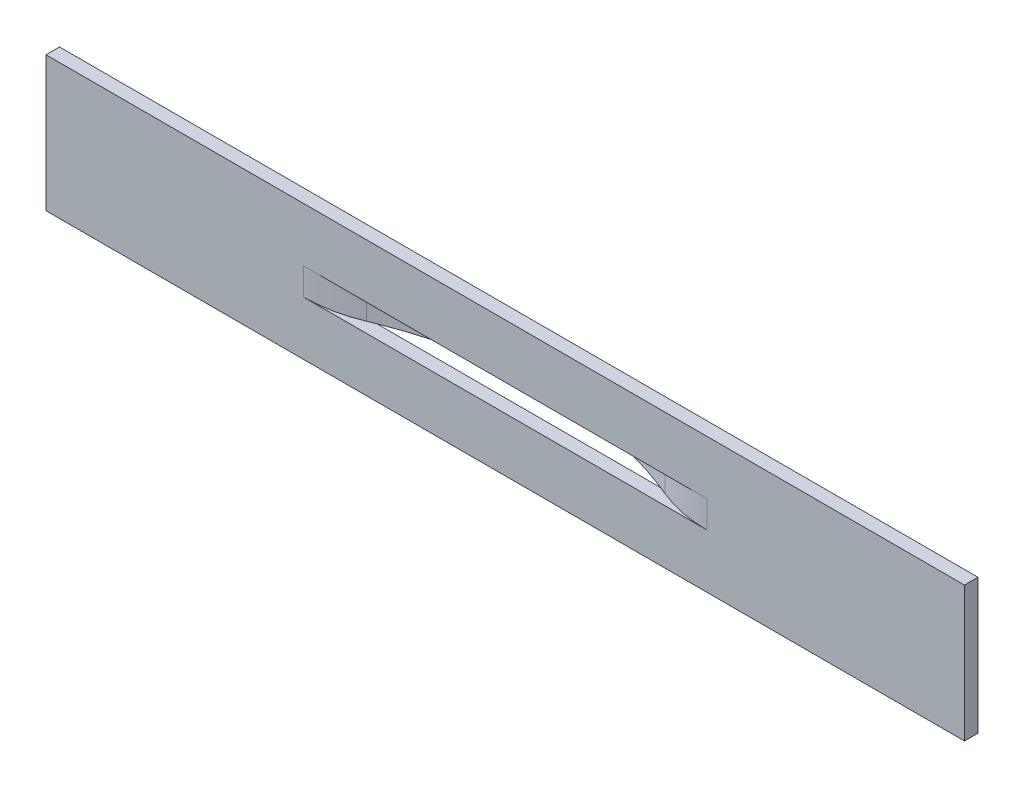
ISO-10303-21;
HEADER;
FILE_DESCRIPTION(('STEP AP214'),'2;1');
FILE_NAME('part.step','',(''),(''),'','','');
FILE_SCHEMA(('AUTOMOTIVE_DESIGN { 1 0 10303 214 1 1 1 1 }'));
ENDSEC;
DATA;
#1=APPLICATION_CONTEXT('core data for automotive mechanical design processes');
#2=APPLICATION_PROTOCOL_DEFINITION('international standard','automotive_design',2000,#1);
#3=PRODUCT_CONTEXT('',#1,'mechanical');
#4=PRODUCT('Part','Part','',(#3));
#5=PRODUCT_RELATED_PRODUCT_CATEGORY('part','',(#4));
#6=PRODUCT_DEFINITION_FORMATION('','',#4);
#7=PRODUCT_DEFINITION_CONTEXT('part definition',#1,'design');
#8=PRODUCT_DEFINITION('design','',#6,#7);
#9=PRODUCT_DEFINITION_SHAPE('','',#8);
#10=(LENGTH_UNIT() NAMED_UNIT(*) SI_UNIT(.MILLI.,.METRE.));
#11=(NAMED_UNIT(*) PLANE_ANGLE_UNIT() SI_UNIT($,.RADIAN.));
#12=(NAMED_UNIT(*) SI_UNIT($,.STERADIAN.) SOLID_ANGLE_UNIT());
#13=UNCERTAINTY_MEASURE_WITH_UNIT(LENGTH_MEASURE(1.E-05),#10,'distance_accuracy_value','');
#14=(GEOMETRIC_REPRESENTATION_CONTEXT(3) GLOBAL_UNCERTAINTY_ASSIGNED_CONTEXT((#13)) GLOBAL_UNIT_ASSIGNED_CONTEXT((#10,
#11,#12)) REPRESENTATION_CONTEXT('',''));
#15=CARTESIAN_POINT('',(0.,0.,0.));
#16=DIRECTION('',(0.,0.,1.));
#17=DIRECTION('',(1.,0.,0.));
#18=AXIS2_PLACEMENT_3D('',#15,#16,#17);
#19=CARTESIAN_POINT('',(0.,10.,0.));
#20=DIRECTION('',(0.,0.,-1.));
#21=DIRECTION('',(-1.,0.,0.));
#22=AXIS2_PLACEMENT_3D('',#19,#20,#21);
#23=PLANE('',#22);
#24=DIRECTION('',(1.,0.,0.));
#25=VECTOR('',#24,1.);
#26=CARTESIAN_POINT('',(0.,0.,0.));
#27=LINE('',#26,#25);
#28=CARTESIAN_POINT('',(0.,0.,0.));
#29=VERTEX_POINT('',#28);
#30=CARTESIAN_POINT('',(68.,0.,0.));
#31=VERTEX_POINT('',#30);
#32=EDGE_CURVE('E236',#29,#31,#27,.T.);
#33=ORIENTED_EDGE('',*,*,#32,.F.);
#34=DIRECTION('',(0.,-1.,0.));
#35=VECTOR('',#34,1.);
#36=CARTESIAN_POINT('',(0.,10.,0.));
#37=LINE('',#36,#35);
#38=CARTESIAN_POINT('',(0.,10.,0.));
#39=VERTEX_POINT('',#38);
#40=EDGE_CURVE('E242',#39,#29,#37,.T.);
#41=ORIENTED_EDGE('',*,*,#40,.F.);
#42=DIRECTION('',(1.,0.,0.));
#43=VECTOR('',#42,1.);
#44=CARTESIAN_POINT('',(0.,10.,0.));
#45=LINE('',#44,#43);
#46=CARTESIAN_POINT('',(68.,10.,0.));
#47=VERTEX_POINT('',#46);
#48=EDGE_CURVE('E224',#39,#47,#45,.T.);
#49=ORIENTED_EDGE('',*,*,#48,.T.);
#50=DIRECTION('',(0.,-1.,0.));
#51=VECTOR('',#50,1.);
#52=CARTESIAN_POINT('',(68.,10.,0.));
#53=LINE('',#52,#51);
#54=EDGE_CURVE('E244',#47,#31,#53,.T.);
#55=ORIENTED_EDGE('',*,*,#54,.T.);
#56=EDGE_LOOP('',(#33,#41,#49,#55));
#57=FACE_BOUND('',#56,.T.);
#58=DIRECTION('',(0.,-1.,0.));
#59=VECTOR('',#58,1.);
#60=CARTESIAN_POINT('',(19.0814712521643,6.,0.));
#61=LINE('',#60,#59);
#62=CARTESIAN_POINT('',(19.0814712521643,6.,0.));
#63=VERTEX_POINT('',#62);
#64=CARTESIAN_POINT('',(19.0814712521643,4.,0.));
#65=VERTEX_POINT('',#64);
#66=EDGE_CURVE('E162',#63,#65,#61,.T.);
#67=ORIENTED_EDGE('',*,*,#66,.T.);
#68=DIRECTION('',(-1.,0.,0.));
#69=VECTOR('',#68,1.);
#70=CARTESIAN_POINT('',(0.,4.,0.));
#71=LINE('',#70,#69);
#72=CARTESIAN_POINT('',(23.4940493052747,4.,0.));
#73=VERTEX_POINT('',#72);
#74=EDGE_CURVE('E184',#65,#73,#71,.F.);
#75=ORIENTED_EDGE('',*,*,#74,.T.);
#76=DIRECTION('',(1.,0.,0.));
#77=VECTOR('',#76,1.);
#78=CARTESIAN_POINT('',(0.,4.,0.));
#79=LINE('',#78,#77);
#80=CARTESIAN_POINT('',(44.5059506947253,4.,0.));
#81=VERTEX_POINT('',#80);
#82=EDGE_CURVE('E49',#73,#81,#79,.T.);
#83=ORIENTED_EDGE('',*,*,#82,.T.);
#84=CARTESIAN_POINT('',(48.9185287478357,4.,0.));
#85=VERTEX_POINT('',#84);
#86=EDGE_CURVE('E182',#81,#85,#71,.F.);
#87=ORIENTED_EDGE('',*,*,#86,.T.);
#88=DIRECTION('',(0.,-1.,0.));
#89=VECTOR('',#88,1.);
#90=CARTESIAN_POINT('',(48.9185287478357,6.,0.));
#91=LINE('',#90,#89);
#92=CARTESIAN_POINT('',(48.9185287478357,6.,0.));
#93=VERTEX_POINT('',#92);
#94=EDGE_CURVE('E56',#85,#93,#91,.F.);
#95=ORIENTED_EDGE('',*,*,#94,.T.);
#96=DIRECTION('',(-1.,0.,0.));
#97=VECTOR('',#96,1.);
#98=CARTESIAN_POINT('',(0.,6.,0.));
#99=LINE('',#98,#97);
#100=CARTESIAN_POINT('',(44.5059506947253,6.,0.));
#101=VERTEX_POINT('',#100);
#102=EDGE_CURVE('E161',#93,#101,#99,.T.);
#103=ORIENTED_EDGE('',*,*,#102,.T.);
#104=DIRECTION('',(1.,0.,0.));
#105=VECTOR('',#104,1.);
#106=CARTESIAN_POINT('',(0.,6.,0.));
#107=LINE('',#106,#105);
#108=CARTESIAN_POINT('',(23.4940493052747,6.,0.));
#109=VERTEX_POINT('',#108);
#110=EDGE_CURVE('E11',#109,#101,#107,.T.);
#111=ORIENTED_EDGE('',*,*,#110,.F.);
#112=EDGE_CURVE('E178',#109,#63,#99,.T.);
#113=ORIENTED_EDGE('',*,*,#112,.T.);
#114=EDGE_LOOP('',(#67,#75,#83,#87,#95,#103,#111,#113));
#115=FACE_BOUND('',#114,.T.);
#116=ADVANCED_FACE('F41',(#57,#115),#23,.T.);
#117=CARTESIAN_POINT('',(0.,10.,1.));
#118=DIRECTION('',(0.,0.,-1.));
#119=DIRECTION('',(-1.,0.,0.));
#120=AXIS2_PLACEMENT_3D('',#117,#118,#119);
#121=PLANE('',#120);
#122=DIRECTION('',(1.,0.,0.));
#123=VECTOR('',#122,1.);
#124=CARTESIAN_POINT('',(0.,0.,1.));
#125=LINE('',#124,#123);
#126=CARTESIAN_POINT('',(0.,0.,1.));
#127=VERTEX_POINT('',#126);
#128=CARTESIAN_POINT('',(68.,0.,1.));
#129=VERTEX_POINT('',#128);
#130=EDGE_CURVE('E217',#127,#129,#125,.T.);
#131=ORIENTED_EDGE('',*,*,#130,.T.);
#132=DIRECTION('',(0.,-1.,0.));
#133=VECTOR('',#132,1.);
#134=CARTESIAN_POINT('',(68.,10.,1.));
#135=LINE('',#134,#133);
#136=CARTESIAN_POINT('',(68.,10.,1.));
#137=VERTEX_POINT('',#136);
#138=EDGE_CURVE('E246',#137,#129,#135,.T.);
#139=ORIENTED_EDGE('',*,*,#138,.F.);
#140=DIRECTION('',(1.,0.,0.));
#141=VECTOR('',#140,1.);
#142=CARTESIAN_POINT('',(0.,10.,1.));
#143=LINE('',#142,#141);
#144=CARTESIAN_POINT('',(0.,10.,1.));
#145=VERTEX_POINT('',#144);
#146=EDGE_CURVE('E218',#145,#137,#143,.T.);
#147=ORIENTED_EDGE('',*,*,#146,.F.);
#148=DIRECTION('',(0.,-1.,0.));
#149=VECTOR('',#148,1.);
#150=CARTESIAN_POINT('',(0.,10.,1.));
#151=LINE('',#150,#149);
#152=EDGE_CURVE('E230',#145,#127,#151,.T.);
#153=ORIENTED_EDGE('',*,*,#152,.T.);
#154=EDGE_LOOP('',(#131,#139,#147,#153));
#155=FACE_BOUND('',#154,.T.);
#156=DIRECTION('',(0.,1.,0.));
#157=VECTOR('',#156,1.);
#158=CARTESIAN_POINT('',(19.0814712521643,4.,1.));
#159=LINE('',#158,#157);
#160=CARTESIAN_POINT('',(19.0814712521643,6.,1.));
#161=VERTEX_POINT('',#160);
#162=CARTESIAN_POINT('',(19.0814712521643,4.,1.));
#163=VERTEX_POINT('',#162);
#164=EDGE_CURVE('E199',#161,#163,#159,.F.);
#165=ORIENTED_EDGE('',*,*,#164,.F.);
#166=DIRECTION('',(-1.,0.,0.));
#167=VECTOR('',#166,1.);
#168=CARTESIAN_POINT('',(46.75,6.,1.));
#169=LINE('',#168,#167);
#170=CARTESIAN_POINT('',(48.9185287478357,6.,1.));
#171=VERTEX_POINT('',#170);
#172=EDGE_CURVE('E188',#171,#161,#169,.T.);
#173=ORIENTED_EDGE('',*,*,#172,.F.);
#174=DIRECTION('',(0.,1.,0.));
#175=VECTOR('',#174,1.);
#176=CARTESIAN_POINT('',(48.9185287478357,6.,1.));
#177=LINE('',#176,#175);
#178=CARTESIAN_POINT('',(48.9185287478357,4.,1.));
#179=VERTEX_POINT('',#178);
#180=EDGE_CURVE('E191',#179,#171,#177,.T.);
#181=ORIENTED_EDGE('',*,*,#180,.F.);
#182=DIRECTION('',(-1.,0.,0.));
#183=VECTOR('',#182,1.);
#184=CARTESIAN_POINT('',(46.75,4.,1.));
#185=LINE('',#184,#183);
#186=EDGE_CURVE('E194',#179,#163,#185,.T.);
#187=ORIENTED_EDGE('',*,*,#186,.T.);
#188=EDGE_LOOP('',(#165,#173,#181,#187));
#189=FACE_BOUND('',#188,.T.);
#190=ADVANCED_FACE('F43',(#155,#189),#121,.F.);
#191=CARTESIAN_POINT('',(68.,10.,0.));
#192=DIRECTION('',(1.,0.,0.));
#193=DIRECTION('',(0.,0.,-1.));
#194=AXIS2_PLACEMENT_3D('',#191,#192,#193);
#195=PLANE('',#194);
#196=DIRECTION('',(0.,0.,1.));
#197=VECTOR('',#196,1.);
#198=CARTESIAN_POINT('',(68.,0.,0.));
#199=LINE('',#198,#197);
#200=EDGE_CURVE('E233',#31,#129,#199,.T.);
#201=ORIENTED_EDGE('',*,*,#200,.F.);
#202=ORIENTED_EDGE('',*,*,#54,.F.);
#203=DIRECTION('',(0.,0.,1.));
#204=VECTOR('',#203,1.);
#205=CARTESIAN_POINT('',(68.,10.,0.));
#206=LINE('',#205,#204);
#207=EDGE_CURVE('E220',#47,#137,#206,.T.);
#208=ORIENTED_EDGE('',*,*,#207,.T.);
#209=ORIENTED_EDGE('',*,*,#138,.T.);
#210=EDGE_LOOP('',(#201,#202,#208,#209));
#211=FACE_BOUND('',#210,.T.);
#212=ADVANCED_FACE('F285',(#211),#195,.T.);
#213=CARTESIAN_POINT('',(0.,10.,1.));
#214=DIRECTION('',(-1.,0.,0.));
#215=DIRECTION('',(0.,0.,1.));
#216=AXIS2_PLACEMENT_3D('',#213,#214,#215);
#217=PLANE('',#216);
#218=DIRECTION('',(0.,0.,-1.));
#219=VECTOR('',#218,1.);
#220=CARTESIAN_POINT('',(0.,0.,1.));
#221=LINE('',#220,#219);
#222=EDGE_CURVE('E221',#127,#29,#221,.T.);
#223=ORIENTED_EDGE('',*,*,#222,.F.);
#224=ORIENTED_EDGE('',*,*,#152,.F.);
#225=DIRECTION('',(0.,0.,-1.));
#226=VECTOR('',#225,1.);
#227=CARTESIAN_POINT('',(0.,10.,1.));
#228=LINE('',#227,#226);
#229=EDGE_CURVE('E227',#145,#39,#228,.T.);
#230=ORIENTED_EDGE('',*,*,#229,.T.);
#231=ORIENTED_EDGE('',*,*,#40,.T.);
#232=EDGE_LOOP('',(#223,#224,#230,#231));
#233=FACE_BOUND('',#232,.T.);
#234=ADVANCED_FACE('F289',(#233),#217,.T.);
#235=CARTESIAN_POINT('',(0.,10.,0.));
#236=DIRECTION('',(0.,-1.,0.));
#237=DIRECTION('',(-1.,0.,0.));
#238=AXIS2_PLACEMENT_3D('',#235,#236,#237);
#239=PLANE('',#238);
#240=ORIENTED_EDGE('',*,*,#146,.T.);
#241=ORIENTED_EDGE('',*,*,#207,.F.);
#242=ORIENTED_EDGE('',*,*,#48,.F.);
#243=ORIENTED_EDGE('',*,*,#229,.F.);
#244=EDGE_LOOP('',(#240,#241,#242,#243));
#245=FACE_BOUND('',#244,.T.);
#246=ADVANCED_FACE('F296',(#245),#239,.F.);
#247=CARTESIAN_POINT('',(0.,0.,0.));
#248=DIRECTION('',(0.,-1.,0.));
#249=DIRECTION('',(-1.,0.,0.));
#250=AXIS2_PLACEMENT_3D('',#247,#248,#249);
#251=PLANE('',#250);
#252=ORIENTED_EDGE('',*,*,#130,.F.);
#253=ORIENTED_EDGE('',*,*,#222,.T.);
#254=ORIENTED_EDGE('',*,*,#32,.T.);
#255=ORIENTED_EDGE('',*,*,#200,.T.);
#256=EDGE_LOOP('',(#252,#253,#254,#255));
#257=FACE_BOUND('',#256,.T.);
#258=ADVANCED_FACE('F303',(#257),#251,.T.);
#259=CARTESIAN_POINT('',(34.,6.,26.59375));
#260=DIRECTION('',(0.,-1.,0.));
#261=DIRECTION('',(1.,0.,0.));
#262=AXIS2_PLACEMENT_3D('',#259,#260,#261);
#263=CYLINDRICAL_SURFACE('',#262,28.59375);
#264=CARTESIAN_POINT('',(34.,4.,26.59375));
#265=DIRECTION('',(0.,1.,0.));
#266=DIRECTION('',(-1.,0.,0.));
#267=AXIS2_PLACEMENT_3D('',#264,#265,#266);
#268=CIRCLE('',#267,28.59375);
#269=CARTESIAN_POINT('',(45.0529990317973,4.,0.222672064777325));
#270=VERTEX_POINT('',#269);
#271=EDGE_CURVE('E192',#270,#81,#268,.T.);
#272=ORIENTED_EDGE('',*,*,#271,.F.);
#273=DIRECTION('',(0.,-1.,0.));
#274=VECTOR('',#273,1.);
#275=CARTESIAN_POINT('',(45.0529990317973,6.,0.222672064777318));
#276=LINE('',#275,#274);
#277=CARTESIAN_POINT('',(45.0529990317973,6.,0.222672064777325));
#278=VERTEX_POINT('',#277);
#279=EDGE_CURVE('E201',#278,#270,#276,.T.);
#280=ORIENTED_EDGE('',*,*,#279,.F.);
#281=CARTESIAN_POINT('',(34.,6.,26.59375));
#282=DIRECTION('',(0.,1.,0.));
#283=DIRECTION('',(-1.,0.,0.));
#284=AXIS2_PLACEMENT_3D('',#281,#282,#283);
#285=CIRCLE('',#284,28.59375);
#286=EDGE_CURVE('E185',#278,#101,#285,.T.);
#287=ORIENTED_EDGE('',*,*,#286,.T.);
#288=CARTESIAN_POINT('',(34.,6.,26.59375));
#289=DIRECTION('',(0.,1.,0.));
#290=DIRECTION('',(-1.,0.,0.));
#291=AXIS2_PLACEMENT_3D('',#288,#289,#290);
#292=CIRCLE('',#291,28.59375);
#293=EDGE_CURVE('E181',#101,#109,#292,.T.);
#294=ORIENTED_EDGE('',*,*,#293,.T.);
#295=CARTESIAN_POINT('',(22.9470009682027,6.,0.222672064777325));
#296=VERTEX_POINT('',#295);
#297=EDGE_CURVE('E189',#109,#296,#285,.T.);
#298=ORIENTED_EDGE('',*,*,#297,.T.);
#299=DIRECTION('',(0.,-1.,0.));
#300=VECTOR('',#299,1.);
#301=CARTESIAN_POINT('',(22.9470009682027,6.,0.222672064777318));
#302=LINE('',#301,#300);
#303=CARTESIAN_POINT('',(22.9470009682027,4.,0.222672064777325));
#304=VERTEX_POINT('',#303);
#305=EDGE_CURVE('E204',#304,#296,#302,.F.);
#306=ORIENTED_EDGE('',*,*,#305,.F.);
#307=EDGE_CURVE('E195',#73,#304,#268,.T.);
#308=ORIENTED_EDGE('',*,*,#307,.F.);
#309=CARTESIAN_POINT('',(34.,4.,26.59375));
#310=DIRECTION('',(0.,1.,0.));
#311=DIRECTION('',(-1.,0.,0.));
#312=AXIS2_PLACEMENT_3D('',#309,#310,#311);
#313=CIRCLE('',#312,28.59375);
#314=EDGE_CURVE('E176',#81,#73,#313,.T.);
#315=ORIENTED_EDGE('',*,*,#314,.F.);
#316=EDGE_LOOP('',(#272,#280,#287,#294,#298,#306,#308,#315));
#317=FACE_BOUND('',#316,.T.);
#318=ADVANCED_FACE('F258',(#317),#263,.F.);
#319=CARTESIAN_POINT('',(34.,6.,26.59375));
#320=DIRECTION('',(0.,1.,0.));
#321=DIRECTION('',(-1.,0.,0.));
#322=AXIS2_PLACEMENT_3D('',#319,#320,#321);
#323=PLANE('',#322);
#324=ORIENTED_EDGE('',*,*,#110,.T.);
#325=ORIENTED_EDGE('',*,*,#286,.F.);
#326=CARTESIAN_POINT('',(48.9185287478357,6.,-9.));
#327=DIRECTION('',(0.,1.,0.));
#328=DIRECTION('',(-1.,0.,0.));
#329=AXIS2_PLACEMENT_3D('',#326,#327,#328);
#330=CIRCLE('',#329,10.);
#331=EDGE_CURVE('E215',#171,#278,#330,.F.);
#332=ORIENTED_EDGE('',*,*,#331,.F.);
#333=ORIENTED_EDGE('',*,*,#172,.T.);
#334=CARTESIAN_POINT('',(19.0814712521643,6.,-9.));
#335=DIRECTION('',(0.,1.,0.));
#336=DIRECTION('',(-1.,0.,0.));
#337=AXIS2_PLACEMENT_3D('',#334,#335,#336);
#338=CIRCLE('',#337,10.);
#339=EDGE_CURVE('E210',#296,#161,#338,.F.);
#340=ORIENTED_EDGE('',*,*,#339,.F.);
#341=ORIENTED_EDGE('',*,*,#297,.F.);
#342=EDGE_LOOP('',(#324,#325,#332,#333,#340,#341));
#343=FACE_BOUND('',#342,.T.);
#344=ADVANCED_FACE('F269',(#343),#323,.F.);
#345=CARTESIAN_POINT('',(34.,4.,26.59375));
#346=DIRECTION('',(0.,1.,0.));
#347=DIRECTION('',(-1.,0.,0.));
#348=AXIS2_PLACEMENT_3D('',#345,#346,#347);
#349=PLANE('',#348);
#350=ORIENTED_EDGE('',*,*,#307,.T.);
#351=CARTESIAN_POINT('',(19.0814712521643,4.,-9.));
#352=DIRECTION('',(0.,1.,0.));
#353=DIRECTION('',(-1.,0.,0.));
#354=AXIS2_PLACEMENT_3D('',#351,#352,#353);
#355=CIRCLE('',#354,10.);
#356=EDGE_CURVE('E207',#163,#304,#355,.T.);
#357=ORIENTED_EDGE('',*,*,#356,.F.);
#358=ORIENTED_EDGE('',*,*,#186,.F.);
#359=CARTESIAN_POINT('',(48.9185287478357,4.,-9.));
#360=DIRECTION('',(0.,1.,0.));
#361=DIRECTION('',(-1.,0.,0.));
#362=AXIS2_PLACEMENT_3D('',#359,#360,#361);
#363=CIRCLE('',#362,10.);
#364=EDGE_CURVE('E213',#270,#179,#363,.T.);
#365=ORIENTED_EDGE('',*,*,#364,.F.);
#366=ORIENTED_EDGE('',*,*,#271,.T.);
#367=ORIENTED_EDGE('',*,*,#82,.F.);
#368=EDGE_LOOP('',(#350,#357,#358,#365,#366,#367));
#369=FACE_BOUND('',#368,.T.);
#370=ADVANCED_FACE('F317',(#369),#349,.T.);
#371=CARTESIAN_POINT('',(19.0814712521643,6.,-9.));
#372=DIRECTION('',(0.,-1.,0.));
#373=DIRECTION('',(1.,0.,0.));
#374=AXIS2_PLACEMENT_3D('',#371,#372,#373);
#375=CYLINDRICAL_SURFACE('',#374,10.);
#376=ORIENTED_EDGE('',*,*,#339,.T.);
#377=ORIENTED_EDGE('',*,*,#164,.T.);
#378=ORIENTED_EDGE('',*,*,#356,.T.);
#379=ORIENTED_EDGE('',*,*,#305,.T.);
#380=EDGE_LOOP('',(#376,#377,#378,#379));
#381=FACE_BOUND('',#380,.T.);
#382=ADVANCED_FACE('F316',(#381),#375,.T.);
#383=CARTESIAN_POINT('',(48.9185287478357,6.,-9.));
#384=DIRECTION('',(0.,-1.,0.));
#385=DIRECTION('',(1.,0.,0.));
#386=AXIS2_PLACEMENT_3D('',#383,#384,#385);
#387=CYLINDRICAL_SURFACE('',#386,10.);
#388=ORIENTED_EDGE('',*,*,#331,.T.);
#389=ORIENTED_EDGE('',*,*,#279,.T.);
#390=ORIENTED_EDGE('',*,*,#364,.T.);
#391=ORIENTED_EDGE('',*,*,#180,.T.);
#392=EDGE_LOOP('',(#388,#389,#390,#391));
#393=FACE_BOUND('',#392,.T.);
#394=ADVANCED_FACE('F320',(#393),#387,.T.);
#395=CARTESIAN_POINT('',(19.0814712521643,4.,-9.));
#396=DIRECTION('',(0.,-1.,0.));
#397=DIRECTION('',(0.,0.,-1.));
#398=AXIS2_PLACEMENT_3D('',#395,#396,#397);
#399=PLANE('',#398);
#400=ORIENTED_EDGE('',*,*,#74,.F.);
#401=CARTESIAN_POINT('',(19.0814712521643,4.,-9.));
#402=DIRECTION('',(0.,-1.,0.));
#403=DIRECTION('',(0.,0.,-1.));
#404=AXIS2_PLACEMENT_3D('',#401,#402,#403);
#405=CIRCLE('',#404,9.);
#406=CARTESIAN_POINT('',(22.5604479965989,4.,-0.699595141700406));
#407=VERTEX_POINT('',#406);
#408=EDGE_CURVE('E64',#65,#407,#405,.F.);
#409=ORIENTED_EDGE('',*,*,#408,.T.);
#410=CARTESIAN_POINT('',(34.,4.,26.59375));
#411=DIRECTION('',(0.,-1.,0.));
#412=DIRECTION('',(0.,0.,-1.));
#413=AXIS2_PLACEMENT_3D('',#410,#411,#412);
#414=CIRCLE('',#413,29.59375);
#415=CARTESIAN_POINT('',(45.4395520034011,4.,-0.699595141700404));
#416=VERTEX_POINT('',#415);
#417=EDGE_CURVE('E167',#416,#407,#414,.F.);
#418=ORIENTED_EDGE('',*,*,#417,.F.);
#419=CARTESIAN_POINT('',(48.9185287478357,4.,-9.));
#420=DIRECTION('',(0.,-1.,0.));
#421=DIRECTION('',(0.,0.,-1.));
#422=AXIS2_PLACEMENT_3D('',#419,#420,#421);
#423=CIRCLE('',#422,9.);
#424=EDGE_CURVE('E148',#416,#85,#423,.F.);
#425=ORIENTED_EDGE('',*,*,#424,.T.);
#426=ORIENTED_EDGE('',*,*,#86,.F.);
#427=ORIENTED_EDGE('',*,*,#314,.T.);
#428=EDGE_LOOP('',(#400,#409,#418,#425,#426,#427));
#429=FACE_BOUND('',#428,.T.);
#430=ADVANCED_FACE('F255',(#429),#399,.T.);
#431=CARTESIAN_POINT('',(48.9185287478357,6.,-9.));
#432=DIRECTION('',(0.,-1.,0.));
#433=DIRECTION('',(0.,0.,-1.));
#434=AXIS2_PLACEMENT_3D('',#431,#432,#433);
#435=PLANE('',#434);
#436=ORIENTED_EDGE('',*,*,#102,.F.);
#437=CARTESIAN_POINT('',(48.9185287478357,6.,-9.));
#438=DIRECTION('',(0.,-1.,0.));
#439=DIRECTION('',(0.,0.,-1.));
#440=AXIS2_PLACEMENT_3D('',#437,#438,#439);
#441=CIRCLE('',#440,9.);
#442=CARTESIAN_POINT('',(45.4395520034011,6.,-0.699595141700409));
#443=VERTEX_POINT('',#442);
#444=EDGE_CURVE('E146',#93,#443,#441,.T.);
#445=ORIENTED_EDGE('',*,*,#444,.T.);
#446=CARTESIAN_POINT('',(34.,6.,26.59375));
#447=DIRECTION('',(0.,-1.,0.));
#448=DIRECTION('',(0.,0.,-1.));
#449=AXIS2_PLACEMENT_3D('',#446,#447,#448);
#450=CIRCLE('',#449,29.59375);
#451=CARTESIAN_POINT('',(22.5604479965989,6.,-0.699595141700406));
#452=VERTEX_POINT('',#451);
#453=EDGE_CURVE('E154',#443,#452,#450,.F.);
#454=ORIENTED_EDGE('',*,*,#453,.T.);
#455=CARTESIAN_POINT('',(19.0814712521643,6.,-9.));
#456=DIRECTION('',(0.,-1.,0.));
#457=DIRECTION('',(0.,0.,-1.));
#458=AXIS2_PLACEMENT_3D('',#455,#456,#457);
#459=CIRCLE('',#458,9.);
#460=EDGE_CURVE('E153',#452,#63,#459,.T.);
#461=ORIENTED_EDGE('',*,*,#460,.T.);
#462=ORIENTED_EDGE('',*,*,#112,.F.);
#463=ORIENTED_EDGE('',*,*,#293,.F.);
#464=EDGE_LOOP('',(#436,#445,#454,#461,#462,#463));
#465=FACE_BOUND('',#464,.T.);
#466=ADVANCED_FACE('F158',(#465),#435,.F.);
#467=CARTESIAN_POINT('',(48.9185287478357,6.,-9.));
#468=DIRECTION('',(0.,-1.,0.));
#469=DIRECTION('',(1.,0.,0.));
#470=AXIS2_PLACEMENT_3D('',#467,#468,#469);
#471=CYLINDRICAL_SURFACE('',#470,9.);
#472=ORIENTED_EDGE('',*,*,#444,.F.);
#473=ORIENTED_EDGE('',*,*,#94,.F.);
#474=ORIENTED_EDGE('',*,*,#424,.F.);
#475=DIRECTION('',(0.,-1.,0.));
#476=VECTOR('',#475,1.);
#477=CARTESIAN_POINT('',(45.4395520034011,6.,-0.699595141700409));
#478=LINE('',#477,#476);
#479=EDGE_CURVE('E143',#443,#416,#478,.T.);
#480=ORIENTED_EDGE('',*,*,#479,.F.);
#481=EDGE_LOOP('',(#472,#473,#474,#480));
#482=FACE_BOUND('',#481,.T.);
#483=ADVANCED_FACE('F145',(#482),#471,.F.);
#484=CARTESIAN_POINT('',(19.0814712521643,6.,-9.));
#485=DIRECTION('',(0.,-1.,0.));
#486=DIRECTION('',(1.,0.,0.));
#487=AXIS2_PLACEMENT_3D('',#484,#485,#486);
#488=CYLINDRICAL_SURFACE('',#487,9.);
#489=ORIENTED_EDGE('',*,*,#460,.F.);
#490=DIRECTION('',(0.,-1.,0.));
#491=VECTOR('',#490,1.);
#492=CARTESIAN_POINT('',(22.5604479965989,6.,-0.699595141700406));
#493=LINE('',#492,#491);
#494=EDGE_CURVE('E165',#407,#452,#493,.F.);
#495=ORIENTED_EDGE('',*,*,#494,.F.);
#496=ORIENTED_EDGE('',*,*,#408,.F.);
#497=ORIENTED_EDGE('',*,*,#66,.F.);
#498=EDGE_LOOP('',(#489,#495,#496,#497));
#499=FACE_BOUND('',#498,.T.);
#500=ADVANCED_FACE('F270',(#499),#488,.F.);
#501=CARTESIAN_POINT('',(34.,6.,26.59375));
#502=DIRECTION('',(0.,-1.,0.));
#503=DIRECTION('',(1.,0.,0.));
#504=AXIS2_PLACEMENT_3D('',#501,#502,#503);
#505=CYLINDRICAL_SURFACE('',#504,29.59375);
#506=ORIENTED_EDGE('',*,*,#417,.T.);
#507=ORIENTED_EDGE('',*,*,#494,.T.);
#508=ORIENTED_EDGE('',*,*,#453,.F.);
#509=ORIENTED_EDGE('',*,*,#479,.T.);
#510=EDGE_LOOP('',(#506,#507,#508,#509));
#511=FACE_BOUND('',#510,.T.);
#512=ADVANCED_FACE('F164',(#511),#505,.T.);
#513=CLOSED_SHELL('',(#116,#190,#212,#234,#246,#258,#318,#344,#370,#382,#394,#430,#466,#483,
#500,#512));
#514=MANIFOLD_SOLID_BREP('B2',#513);
#515=ADVANCED_BREP_SHAPE_REPRESENTATION('',(#18,#514),#14);
#516=SHAPE_DEFINITION_REPRESENTATION(#9,#515);
ENDSEC;
END-ISO-10303-21;
